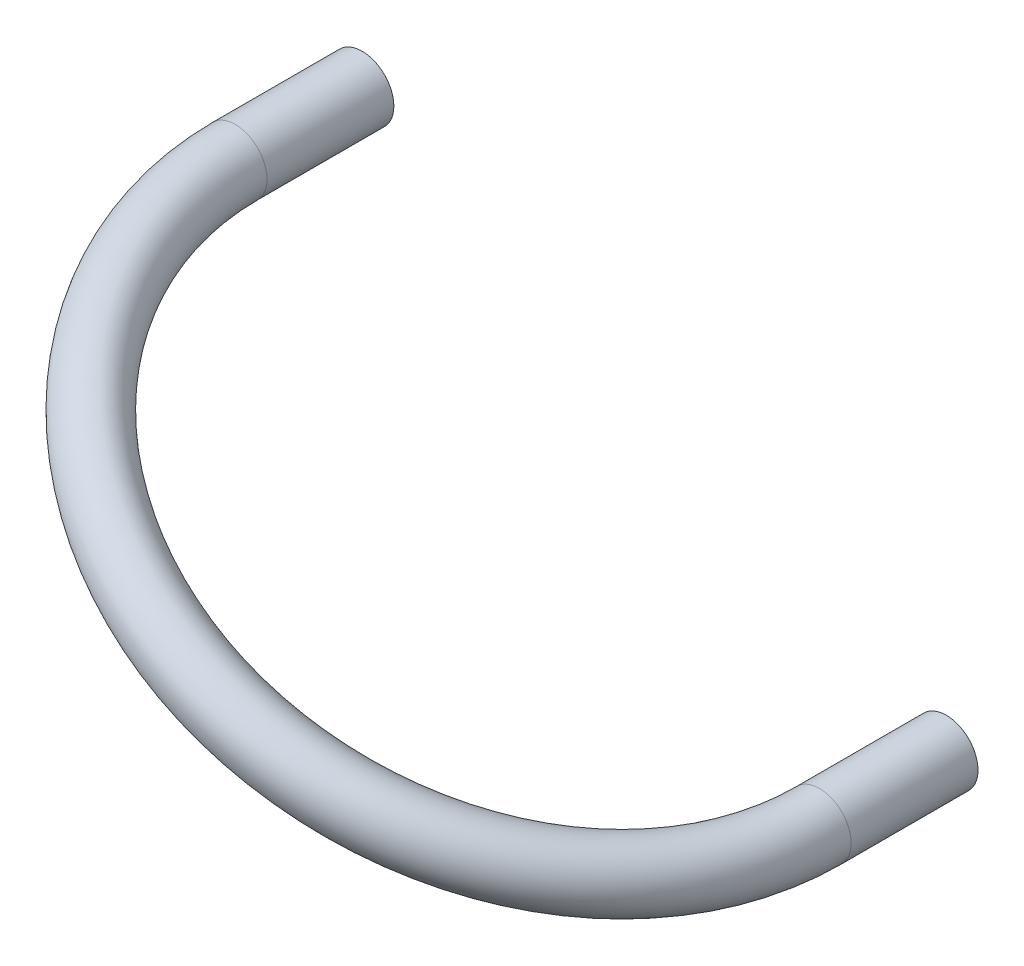
ISO-10303-21;
HEADER;
FILE_DESCRIPTION(('STEP AP214'),'2;1');
FILE_NAME('part.step','',(''),(''),'','','');
FILE_SCHEMA(('AUTOMOTIVE_DESIGN { 1 0 10303 214 1 1 1 1 }'));
ENDSEC;
DATA;
#1=APPLICATION_CONTEXT('core data for automotive mechanical design processes');
#2=APPLICATION_PROTOCOL_DEFINITION('international standard','automotive_design',2000,#1);
#3=PRODUCT_CONTEXT('',#1,'mechanical');
#4=PRODUCT('Part','Part','',(#3));
#5=PRODUCT_RELATED_PRODUCT_CATEGORY('part','',(#4));
#6=PRODUCT_DEFINITION_FORMATION('','',#4);
#7=PRODUCT_DEFINITION_CONTEXT('part definition',#1,'design');
#8=PRODUCT_DEFINITION('design','',#6,#7);
#9=PRODUCT_DEFINITION_SHAPE('','',#8);
#10=(LENGTH_UNIT() NAMED_UNIT(*) SI_UNIT(.MILLI.,.METRE.));
#11=(NAMED_UNIT(*) PLANE_ANGLE_UNIT() SI_UNIT($,.RADIAN.));
#12=(NAMED_UNIT(*) SI_UNIT($,.STERADIAN.) SOLID_ANGLE_UNIT());
#13=UNCERTAINTY_MEASURE_WITH_UNIT(LENGTH_MEASURE(1.E-05),#10,'distance_accuracy_value','');
#14=(GEOMETRIC_REPRESENTATION_CONTEXT(3) GLOBAL_UNCERTAINTY_ASSIGNED_CONTEXT((#13)) GLOBAL_UNIT_ASSIGNED_CONTEXT((#10,
#11,#12)) REPRESENTATION_CONTEXT('',''));
#15=CARTESIAN_POINT('',(0.,0.,0.));
#16=DIRECTION('',(0.,0.,1.));
#17=DIRECTION('',(1.,0.,0.));
#18=AXIS2_PLACEMENT_3D('',#15,#16,#17);
#19=CARTESIAN_POINT('',(-133.107305447596,76.2449999999998,-69.1299999999996));
#20=DIRECTION('',(0.,0.,-1.));
#21=DIRECTION('',(-0.619937699544686,0.784651036246842,0.));
#22=AXIS2_PLACEMENT_3D('',#19,#20,#21);
#23=PLANE('',#22);
#24=CARTESIAN_POINT('',(-133.107305447596,76.2449999999998,-69.1299999999996));
#25=DIRECTION('',(0.,0.,-1.));
#26=DIRECTION('',(-1.,0.,0.));
#27=AXIS2_PLACEMENT_3D('',#24,#25,#26);
#28=CIRCLE('',#27,2.7625);
#29=CARTESIAN_POINT('',(-135.869805447596,76.2449999999998,-69.1299999999996));
#30=VERTEX_POINT('',#29);
#31=EDGE_CURVE('E67',#30,#30,#28,.T.);
#32=ORIENTED_EDGE('',*,*,#31,.F.);
#33=EDGE_LOOP('',(#32));
#34=FACE_BOUND('',#33,.T.);
#35=CARTESIAN_POINT('',(-133.107305447596,76.2449999999998,-69.1299999999996));
#36=DIRECTION('',(0.,0.,-1.));
#37=DIRECTION('',(-0.619937699544686,0.784651036246842,0.));
#38=AXIS2_PLACEMENT_3D('',#35,#36,#37);
#39=CIRCLE('',#38,4.7625);
#40=CARTESIAN_POINT('',(-136.059758741677,79.9819005601254,-69.1299999999996));
#41=VERTEX_POINT('',#40);
#42=EDGE_CURVE('E58',#41,#41,#39,.T.);
#43=ORIENTED_EDGE('',*,*,#42,.T.);
#44=EDGE_LOOP('',(#43));
#45=FACE_BOUND('',#44,.T.);
#46=ADVANCED_FACE('F44',(#34,#45),#23,.T.);
#47=CARTESIAN_POINT('',(-45.3749896000001,33.75,-69.1299999999996));
#48=DIRECTION('',(0.,0.,1.));
#49=DIRECTION('',(1.,0.,0.));
#50=AXIS2_PLACEMENT_3D('',#47,#48,#49);
#51=PLANE('',#50);
#52=CARTESIAN_POINT('',(-45.3749896,33.75,-69.1299999999996));
#53=DIRECTION('',(0.,0.,1.));
#54=DIRECTION('',(1.,0.,0.));
#55=AXIS2_PLACEMENT_3D('',#52,#53,#54);
#56=CIRCLE('',#55,2.7625);
#57=CARTESIAN_POINT('',(-42.6124896,33.75,-69.1299999999996));
#58=VERTEX_POINT('',#57);
#59=EDGE_CURVE('E63',#58,#58,#56,.T.);
#60=ORIENTED_EDGE('',*,*,#59,.T.);
#61=EDGE_LOOP('',(#60));
#62=FACE_BOUND('',#61,.T.);
#63=CARTESIAN_POINT('',(-45.3749896000001,33.75,-69.1299999999996));
#64=DIRECTION('',(0.,0.,1.));
#65=DIRECTION('',(1.,0.,0.));
#66=AXIS2_PLACEMENT_3D('',#63,#64,#65);
#67=CIRCLE('',#66,4.7625);
#68=CARTESIAN_POINT('',(-40.6124896000001,33.75,-69.1299999999996));
#69=VERTEX_POINT('',#68);
#70=EDGE_CURVE('E11',#69,#69,#67,.T.);
#71=ORIENTED_EDGE('',*,*,#70,.F.);
#72=EDGE_LOOP('',(#71));
#73=FACE_BOUND('',#72,.T.);
#74=ADVANCED_FACE('F87',(#62,#73),#51,.F.);
#75=CARTESIAN_POINT('',(-133.107305447596,76.2449999999998,-69.1299999999996));
#76=DIRECTION('',(0.,0.,1.));
#77=DIRECTION('',(1.,0.,0.));
#78=AXIS2_PLACEMENT_3D('',#75,#76,#77);
#79=CYLINDRICAL_SURFACE('',#78,4.7625);
#80=CARTESIAN_POINT('',(-133.107305447596,76.2449999999998,-50.0799999999996));
#81=DIRECTION('',(0.,0.,-1.));
#82=DIRECTION('',(-0.619937699544686,0.784651036246842,0.));
#83=AXIS2_PLACEMENT_3D('',#80,#81,#82);
#84=CIRCLE('',#83,4.7625);
#85=CARTESIAN_POINT('',(-137.393473028493,78.3210957874018,-50.0799999999996));
#86=VERTEX_POINT('',#85);
#87=EDGE_CURVE('E54',#86,#86,#84,.T.);
#88=ORIENTED_EDGE('',*,*,#87,.T.);
#89=EDGE_LOOP('',(#88));
#90=FACE_BOUND('',#89,.T.);
#91=ORIENTED_EDGE('',*,*,#42,.F.);
#92=EDGE_LOOP('',(#91));
#93=FACE_BOUND('',#92,.T.);
#94=ADVANCED_FACE('F91',(#90,#93),#79,.T.);
#95=CARTESIAN_POINT('',(-89.2411475237979,54.9974999999999,-50.0799999999996));
#96=DIRECTION('',(0.435925624651336,0.899982694151584,0.));
#97=DIRECTION('',(-0.899982694151584,0.435925624651336,0.));
#98=AXIS2_PLACEMENT_3D('',#95,#96,#97);
#99=TOROIDAL_SURFACE('',#98,48.7411127001176,4.7625);
#100=CARTESIAN_POINT('',(-45.3749896,33.75,-50.0799999999996));
#101=DIRECTION('',(0.,0.,1.));
#102=DIRECTION('',(1.,0.,0.));
#103=AXIS2_PLACEMENT_3D('',#100,#101,#102);
#104=CIRCLE('',#103,4.7625);
#105=CARTESIAN_POINT('',(-41.0888220191031,31.673904212598,-50.0799999999996));
#106=VERTEX_POINT('',#105);
#107=EDGE_CURVE('E50',#106,#106,#104,.T.);
#108=CARTESIAN_POINT('',(-89.2411475237979,54.9974999999999,-50.0799999999996));
#109=DIRECTION('',(0.435925624651336,0.899982694151584,0.));
#110=DIRECTION('',(-0.899982694151584,0.435925624651336,0.));
#111=AXIS2_PLACEMENT_3D('',#108,#109,#110);
#112=CIRCLE('',#111,53.5036127001176);
#113=EDGE_CURVE('',#86,#106,#112,.T.);
#114=ORIENTED_EDGE('',*,*,#87,.F.);
#115=ORIENTED_EDGE('',*,*,#107,.T.);
#116=ORIENTED_EDGE('',*,*,#113,.T.);
#117=ORIENTED_EDGE('',*,*,#113,.F.);
#118=EDGE_LOOP('',(#114,#116,#115,#117));
#119=FACE_BOUND('',#118,.T.);
#120=ADVANCED_FACE('F93',(#119),#99,.T.);
#121=CARTESIAN_POINT('',(-45.3749896,33.75,-50.0799999999996));
#122=DIRECTION('',(0.,0.,-1.));
#123=DIRECTION('',(-1.,0.,0.));
#124=AXIS2_PLACEMENT_3D('',#121,#122,#123);
#125=CYLINDRICAL_SURFACE('',#124,4.7625);
#126=ORIENTED_EDGE('',*,*,#70,.T.);
#127=EDGE_LOOP('',(#126));
#128=FACE_BOUND('',#127,.T.);
#129=ORIENTED_EDGE('',*,*,#107,.F.);
#130=EDGE_LOOP('',(#129));
#131=FACE_BOUND('',#130,.T.);
#132=ADVANCED_FACE('F81',(#128,#131),#125,.T.);
#133=CARTESIAN_POINT('',(-133.107305447596,76.2449999999998,-69.1299999999996));
#134=DIRECTION('',(0.,0.,1.));
#135=DIRECTION('',(1.,0.,0.));
#136=AXIS2_PLACEMENT_3D('',#133,#134,#135);
#137=CYLINDRICAL_SURFACE('',#136,2.7625);
#138=CARTESIAN_POINT('',(-133.107305447596,76.2449999999998,-50.0799999999996));
#139=DIRECTION('',(0.,0.,1.));
#140=DIRECTION('',(1.,0.,0.));
#141=AXIS2_PLACEMENT_3D('',#138,#139,#140);
#142=CIRCLE('',#141,2.7625);
#143=CARTESIAN_POINT('',(-135.593507640189,77.4492445380991,-50.0799999999996));
#144=VERTEX_POINT('',#143);
#145=EDGE_CURVE('E70',#144,#144,#142,.F.);
#146=ORIENTED_EDGE('',*,*,#145,.F.);
#147=EDGE_LOOP('',(#146));
#148=FACE_BOUND('',#147,.T.);
#149=ORIENTED_EDGE('',*,*,#31,.T.);
#150=EDGE_LOOP('',(#149));
#151=FACE_BOUND('',#150,.T.);
#152=ADVANCED_FACE('F78',(#148,#151),#137,.F.);
#153=CARTESIAN_POINT('',(-89.2411475237979,54.9974999999999,-50.0799999999996));
#154=DIRECTION('',(0.435925624651336,0.899982694151584,0.));
#155=DIRECTION('',(-0.899982694151584,0.435925624651336,0.));
#156=AXIS2_PLACEMENT_3D('',#153,#154,#155);
#157=TOROIDAL_SURFACE('',#156,48.7411127001176,2.7625);
#158=CARTESIAN_POINT('',(-45.3749896000001,33.75,-50.0799999999996));
#159=DIRECTION('',(0.,0.,1.));
#160=DIRECTION('',(1.,0.,0.));
#161=AXIS2_PLACEMENT_3D('',#158,#159,#160);
#162=CIRCLE('',#161,2.7625);
#163=CARTESIAN_POINT('',(-42.8887874074063,32.5457554619007,-50.0799999999996));
#164=VERTEX_POINT('',#163);
#165=EDGE_CURVE('E66',#164,#164,#162,.T.);
#166=CARTESIAN_POINT('',(-89.2411475237979,54.9974999999999,-50.0799999999996));
#167=DIRECTION('',(0.435925624651336,0.899982694151584,0.));
#168=DIRECTION('',(-0.899982694151584,0.435925624651336,0.));
#169=AXIS2_PLACEMENT_3D('',#166,#167,#168);
#170=CIRCLE('',#169,51.5036127001176);
#171=EDGE_CURVE('',#144,#164,#170,.T.);
#172=ORIENTED_EDGE('',*,*,#145,.T.);
#173=ORIENTED_EDGE('',*,*,#165,.F.);
#174=ORIENTED_EDGE('',*,*,#171,.T.);
#175=ORIENTED_EDGE('',*,*,#171,.F.);
#176=EDGE_LOOP('',(#172,#174,#173,#175));
#177=FACE_BOUND('',#176,.T.);
#178=ADVANCED_FACE('F76',(#177),#157,.F.);
#179=CARTESIAN_POINT('',(-45.3749896,33.75,-50.0799999999996));
#180=DIRECTION('',(0.,0.,-1.));
#181=DIRECTION('',(-1.,0.,0.));
#182=AXIS2_PLACEMENT_3D('',#179,#180,#181);
#183=CYLINDRICAL_SURFACE('',#182,2.7625);
#184=ORIENTED_EDGE('',*,*,#59,.F.);
#185=EDGE_LOOP('',(#184));
#186=FACE_BOUND('',#185,.T.);
#187=ORIENTED_EDGE('',*,*,#165,.T.);
#188=EDGE_LOOP('',(#187));
#189=FACE_BOUND('',#188,.T.);
#190=ADVANCED_FACE('F88',(#186,#189),#183,.F.);
#191=CLOSED_SHELL('',(#46,#74,#94,#120,#132,#152,#178,#190));
#192=MANIFOLD_SOLID_BREP('B2',#191);
#193=ADVANCED_BREP_SHAPE_REPRESENTATION('',(#18,#192),#14);
#194=SHAPE_DEFINITION_REPRESENTATION(#9,#193);
ENDSEC;
END-ISO-10303-21;
